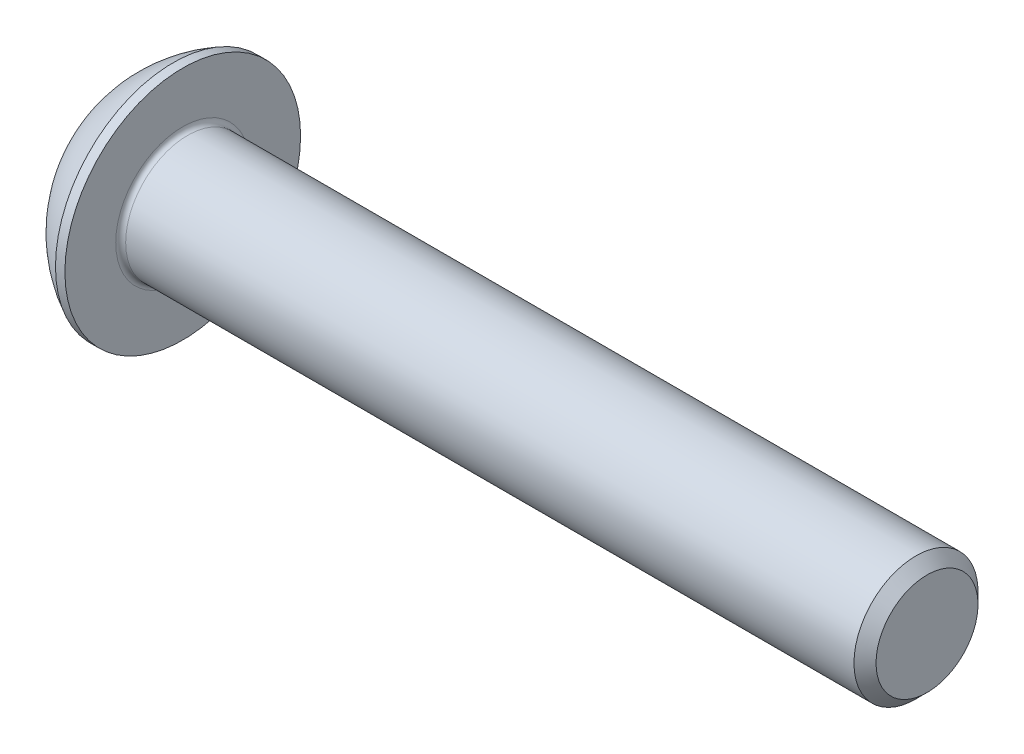
ISO-10303-21;
HEADER;
FILE_DESCRIPTION(('STEP AP214'),'2;1');
FILE_NAME('part.step','',(''),(''),'','','');
FILE_SCHEMA(('AUTOMOTIVE_DESIGN { 1 0 10303 214 1 1 1 1 }'));
ENDSEC;
DATA;
#1=APPLICATION_CONTEXT('core data for automotive mechanical design processes');
#2=APPLICATION_PROTOCOL_DEFINITION('international standard','automotive_design',2000,#1);
#3=PRODUCT_CONTEXT('',#1,'mechanical');
#4=PRODUCT('Part','Part','',(#3));
#5=PRODUCT_RELATED_PRODUCT_CATEGORY('part','',(#4));
#6=PRODUCT_DEFINITION_FORMATION('','',#4);
#7=PRODUCT_DEFINITION_CONTEXT('part definition',#1,'design');
#8=PRODUCT_DEFINITION('design','',#6,#7);
#9=PRODUCT_DEFINITION_SHAPE('','',#8);
#10=(LENGTH_UNIT() NAMED_UNIT(*) SI_UNIT(.MILLI.,.METRE.));
#11=(NAMED_UNIT(*) PLANE_ANGLE_UNIT() SI_UNIT($,.RADIAN.));
#12=(NAMED_UNIT(*) SI_UNIT($,.STERADIAN.) SOLID_ANGLE_UNIT());
#13=UNCERTAINTY_MEASURE_WITH_UNIT(LENGTH_MEASURE(1.E-05),#10,'distance_accuracy_value','');
#14=(GEOMETRIC_REPRESENTATION_CONTEXT(3) GLOBAL_UNCERTAINTY_ASSIGNED_CONTEXT((#13)) GLOBAL_UNIT_ASSIGNED_CONTEXT((#10,
#11,#12)) REPRESENTATION_CONTEXT('',''));
#15=CARTESIAN_POINT('',(0.,0.,0.));
#16=DIRECTION('',(0.,0.,1.));
#17=DIRECTION('',(1.,0.,0.));
#18=AXIS2_PLACEMENT_3D('',#15,#16,#17);
#19=CARTESIAN_POINT('',(0.,0.,0.));
#20=DIRECTION('',(-1.,0.,0.));
#21=DIRECTION('',(0.,0.,1.));
#22=AXIS2_PLACEMENT_3D('',#19,#20,#21);
#23=PLANE('',#22);
#24=CARTESIAN_POINT('',(0.,0.,0.));
#25=DIRECTION('',(-1.,0.,0.));
#26=DIRECTION('',(0.,0.,1.));
#27=AXIS2_PLACEMENT_3D('',#24,#25,#26);
#28=CIRCLE('',#27,2.375);
#29=CARTESIAN_POINT('',(0.,0.,2.375));
#30=VERTEX_POINT('',#29);
#31=EDGE_CURVE('E163',#30,#30,#28,.T.);
#32=ORIENTED_EDGE('',*,*,#31,.T.);
#33=EDGE_LOOP('',(#32));
#34=FACE_BOUND('',#33,.T.);
#35=DIRECTION('',(0.,-1.,0.));
#36=VECTOR('',#35,1.);
#37=CARTESIAN_POINT('',(0.,-0.866025403784438,1.5));
#38=LINE('',#37,#36);
#39=CARTESIAN_POINT('',(0.,0.866025403784439,1.5));
#40=VERTEX_POINT('',#39);
#41=CARTESIAN_POINT('',(0.,-0.866025403784438,1.5));
#42=VERTEX_POINT('',#41);
#43=EDGE_CURVE('E53',#40,#42,#38,.T.);
#44=ORIENTED_EDGE('',*,*,#43,.T.);
#45=DIRECTION('',(0.,-0.5,-0.866025403784439));
#46=VECTOR('',#45,1.);
#47=CARTESIAN_POINT('',(0.,-1.73205080756888,0.));
#48=LINE('',#47,#46);
#49=CARTESIAN_POINT('',(0.,-1.73205080756888,0.));
#50=VERTEX_POINT('',#49);
#51=EDGE_CURVE('E256',#42,#50,#48,.T.);
#52=ORIENTED_EDGE('',*,*,#51,.T.);
#53=DIRECTION('',(0.,0.5,-0.866025403784439));
#54=VECTOR('',#53,1.);
#55=CARTESIAN_POINT('',(0.,-0.866025403784438,-1.5));
#56=LINE('',#55,#54);
#57=CARTESIAN_POINT('',(0.,-0.866025403784438,-1.5));
#58=VERTEX_POINT('',#57);
#59=EDGE_CURVE('E138',#50,#58,#56,.T.);
#60=ORIENTED_EDGE('',*,*,#59,.T.);
#61=DIRECTION('',(0.,1.,0.));
#62=VECTOR('',#61,1.);
#63=CARTESIAN_POINT('',(0.,0.866025403784439,-1.5));
#64=LINE('',#63,#62);
#65=CARTESIAN_POINT('',(0.,0.866025403784439,-1.5));
#66=VERTEX_POINT('',#65);
#67=EDGE_CURVE('E259',#58,#66,#64,.T.);
#68=ORIENTED_EDGE('',*,*,#67,.T.);
#69=DIRECTION('',(0.,0.5,0.866025403784439));
#70=VECTOR('',#69,1.);
#71=CARTESIAN_POINT('',(0.,1.73205080756888,0.));
#72=LINE('',#71,#70);
#73=CARTESIAN_POINT('',(0.,1.73205080756888,0.));
#74=VERTEX_POINT('',#73);
#75=EDGE_CURVE('E261',#66,#74,#72,.T.);
#76=ORIENTED_EDGE('',*,*,#75,.T.);
#77=DIRECTION('',(0.,-0.5,0.866025403784439));
#78=VECTOR('',#77,1.);
#79=CARTESIAN_POINT('',(0.,0.866025403784439,1.5));
#80=LINE('',#79,#78);
#81=EDGE_CURVE('E263',#74,#40,#80,.T.);
#82=ORIENTED_EDGE('',*,*,#81,.T.);
#83=EDGE_LOOP('',(#44,#52,#60,#68,#76,#82));
#84=FACE_BOUND('',#83,.T.);
#85=ADVANCED_FACE('F38',(#34,#84),#23,.T.);
#86=CARTESIAN_POINT('',(4.75501582278481,0.,0.));
#87=DIRECTION('',(-1.,0.,0.));
#88=DIRECTION('',(0.,1.,0.));
#89=AXIS2_PLACEMENT_3D('',#86,#87,#88);
#90=SPHERICAL_SURFACE('',#89,5.3151482081814);
#91=CARTESIAN_POINT('',(2.37,0.,0.));
#92=DIRECTION('',(-1.,0.,0.));
#93=DIRECTION('',(0.,0.,1.));
#94=AXIS2_PLACEMENT_3D('',#91,#92,#93);
#95=CIRCLE('',#94,4.75);
#96=CARTESIAN_POINT('',(2.37,0.,4.75));
#97=VERTEX_POINT('',#96);
#98=EDGE_CURVE('E160',#97,#97,#95,.T.);
#99=ORIENTED_EDGE('',*,*,#98,.T.);
#100=EDGE_LOOP('',(#99));
#101=FACE_BOUND('',#100,.T.);
#102=ORIENTED_EDGE('',*,*,#31,.F.);
#103=EDGE_LOOP('',(#102));
#104=FACE_BOUND('',#103,.T.);
#105=ADVANCED_FACE('F184',(#101,#104),#90,.T.);
#106=CARTESIAN_POINT('',(0.,0.,0.));
#107=DIRECTION('',(-1.,0.,0.));
#108=DIRECTION('',(0.,0.,1.));
#109=AXIS2_PLACEMENT_3D('',#106,#107,#108);
#110=CYLINDRICAL_SURFACE('',#109,4.75);
#111=ORIENTED_EDGE('',*,*,#98,.F.);
#112=EDGE_LOOP('',(#111));
#113=FACE_BOUND('',#112,.T.);
#114=CARTESIAN_POINT('',(2.75,0.,0.));
#115=DIRECTION('',(-1.,0.,0.));
#116=DIRECTION('',(0.,0.,1.));
#117=AXIS2_PLACEMENT_3D('',#114,#115,#116);
#118=CIRCLE('',#117,4.75);
#119=CARTESIAN_POINT('',(2.75,0.,4.75));
#120=VERTEX_POINT('',#119);
#121=EDGE_CURVE('E157',#120,#120,#118,.T.);
#122=ORIENTED_EDGE('',*,*,#121,.T.);
#123=EDGE_LOOP('',(#122));
#124=FACE_BOUND('',#123,.T.);
#125=ADVANCED_FACE('F189',(#113,#124),#110,.T.);
#126=CARTESIAN_POINT('',(2.75,2.5,0.));
#127=DIRECTION('',(-1.,0.,0.));
#128=DIRECTION('',(0.,0.,1.));
#129=AXIS2_PLACEMENT_3D('',#126,#127,#128);
#130=PLANE('',#129);
#131=CARTESIAN_POINT('',(2.75,0.,0.));
#132=DIRECTION('',(-1.,0.,0.));
#133=DIRECTION('',(0.,0.,1.));
#134=AXIS2_PLACEMENT_3D('',#131,#132,#133);
#135=CIRCLE('',#134,2.7);
#136=CARTESIAN_POINT('',(2.75,0.,2.7));
#137=VERTEX_POINT('',#136);
#138=EDGE_CURVE('E46',#137,#137,#135,.T.);
#139=ORIENTED_EDGE('',*,*,#138,.T.);
#140=EDGE_LOOP('',(#139));
#141=FACE_BOUND('',#140,.T.);
#142=ORIENTED_EDGE('',*,*,#121,.F.);
#143=EDGE_LOOP('',(#142));
#144=FACE_BOUND('',#143,.T.);
#145=ADVANCED_FACE('F168',(#141,#144),#130,.F.);
#146=CARTESIAN_POINT('',(0.,0.,0.));
#147=DIRECTION('',(-1.,0.,0.));
#148=DIRECTION('',(0.,0.,1.));
#149=AXIS2_PLACEMENT_3D('',#146,#147,#148);
#150=CYLINDRICAL_SURFACE('',#149,2.5);
#151=CARTESIAN_POINT('',(2.95,0.,0.));
#152=DIRECTION('',(-1.,0.,0.));
#153=DIRECTION('',(0.,0.,1.));
#154=AXIS2_PLACEMENT_3D('',#151,#152,#153);
#155=CIRCLE('',#154,2.5);
#156=CARTESIAN_POINT('',(2.95,0.,2.5));
#157=VERTEX_POINT('',#156);
#158=EDGE_CURVE('E11',#157,#157,#155,.F.);
#159=ORIENTED_EDGE('',*,*,#158,.T.);
#160=EDGE_LOOP('',(#159));
#161=FACE_BOUND('',#160,.T.);
#162=CARTESIAN_POINT('',(32.305,0.,0.));
#163=DIRECTION('',(-1.,0.,0.));
#164=DIRECTION('',(0.,0.,1.));
#165=AXIS2_PLACEMENT_3D('',#162,#163,#164);
#166=CIRCLE('',#165,2.5);
#167=CARTESIAN_POINT('',(32.305,0.,2.5));
#168=VERTEX_POINT('',#167);
#169=EDGE_CURVE('E154',#168,#168,#166,.T.);
#170=ORIENTED_EDGE('',*,*,#169,.T.);
#171=EDGE_LOOP('',(#170));
#172=FACE_BOUND('',#171,.T.);
#173=ADVANCED_FACE('F198',(#161,#172),#150,.T.);
#174=CARTESIAN_POINT('',(32.75,0.,0.));
#175=DIRECTION('',(-1.,0.,0.));
#176=DIRECTION('',(0.,0.,1.));
#177=AXIS2_PLACEMENT_3D('',#174,#175,#176);
#178=CONICAL_SURFACE('',#177,2.055,0.785398163397436);
#179=ORIENTED_EDGE('',*,*,#169,.F.);
#180=EDGE_LOOP('',(#179));
#181=FACE_BOUND('',#180,.T.);
#182=CARTESIAN_POINT('',(32.75,0.,0.));
#183=DIRECTION('',(-1.,0.,0.));
#184=DIRECTION('',(0.,0.,1.));
#185=AXIS2_PLACEMENT_3D('',#182,#183,#184);
#186=CIRCLE('',#185,2.055);
#187=CARTESIAN_POINT('',(32.75,0.,2.055));
#188=VERTEX_POINT('',#187);
#189=EDGE_CURVE('E150',#188,#188,#186,.T.);
#190=ORIENTED_EDGE('',*,*,#189,.T.);
#191=EDGE_LOOP('',(#190));
#192=FACE_BOUND('',#191,.T.);
#193=ADVANCED_FACE('F179',(#181,#192),#178,.T.);
#194=CARTESIAN_POINT('',(32.75,0.,0.));
#195=DIRECTION('',(-1.,0.,0.));
#196=DIRECTION('',(0.,0.,1.));
#197=AXIS2_PLACEMENT_3D('',#194,#195,#196);
#198=PLANE('',#197);
#199=ORIENTED_EDGE('',*,*,#189,.F.);
#200=EDGE_LOOP('',(#199));
#201=FACE_BOUND('',#200,.T.);
#202=ADVANCED_FACE('F172',(#201),#198,.F.);
#203=CARTESIAN_POINT('',(2.95,0.,0.));
#204=DIRECTION('',(-1.,0.,0.));
#205=DIRECTION('',(0.,0.,1.));
#206=AXIS2_PLACEMENT_3D('',#203,#204,#205);
#207=TOROIDAL_SURFACE('',#206,2.7,0.2);
#208=ORIENTED_EDGE('',*,*,#158,.F.);
#209=EDGE_LOOP('',(#208));
#210=FACE_BOUND('',#209,.T.);
#211=ORIENTED_EDGE('',*,*,#138,.F.);
#212=EDGE_LOOP('',(#211));
#213=FACE_BOUND('',#212,.T.);
#214=ADVANCED_FACE('F40',(#210,#213),#207,.F.);
#215=CARTESIAN_POINT('',(1.56,-1.73205080756888,0.));
#216=DIRECTION('',(0.,0.866025403784439,-0.5));
#217=DIRECTION('',(0.,0.5,0.866025403784439));
#218=AXIS2_PLACEMENT_3D('',#215,#216,#217);
#219=PLANE('',#218);
#220=DIRECTION('',(0.,-0.5,-0.866025403784439));
#221=VECTOR('',#220,1.);
#222=CARTESIAN_POINT('',(1.56,-1.73205080756888,0.));
#223=LINE('',#222,#221);
#224=CARTESIAN_POINT('',(1.56,-0.866025403784438,1.5));
#225=VERTEX_POINT('',#224);
#226=CARTESIAN_POINT('',(1.56,-1.29903810567666,0.749999999999999));
#227=VERTEX_POINT('',#226);
#228=EDGE_CURVE('E121',#225,#227,#223,.T.);
#229=ORIENTED_EDGE('',*,*,#228,.T.);
#230=CARTESIAN_POINT('',(1.56,-1.73205080756888,0.));
#231=VERTEX_POINT('',#230);
#232=EDGE_CURVE('E114',#227,#231,#223,.T.);
#233=ORIENTED_EDGE('',*,*,#232,.T.);
#234=DIRECTION('',(-1.,0.,0.));
#235=VECTOR('',#234,1.);
#236=CARTESIAN_POINT('',(1.56,-1.73205080756888,0.));
#237=LINE('',#236,#235);
#238=EDGE_CURVE('E118',#231,#50,#237,.T.);
#239=ORIENTED_EDGE('',*,*,#238,.T.);
#240=ORIENTED_EDGE('',*,*,#51,.F.);
#241=DIRECTION('',(-1.,0.,0.));
#242=VECTOR('',#241,1.);
#243=CARTESIAN_POINT('',(1.56,-0.866025403784438,1.5));
#244=LINE('',#243,#242);
#245=EDGE_CURVE('E246',#225,#42,#244,.T.);
#246=ORIENTED_EDGE('',*,*,#245,.F.);
#247=EDGE_LOOP('',(#229,#233,#239,#240,#246));
#248=FACE_BOUND('',#247,.T.);
#249=ADVANCED_FACE('F116',(#248),#219,.T.);
#250=CARTESIAN_POINT('',(1.56,-0.866025403784438,-1.5));
#251=DIRECTION('',(0.,0.866025403784439,0.5));
#252=DIRECTION('',(0.,-0.5,0.866025403784439));
#253=AXIS2_PLACEMENT_3D('',#250,#251,#252);
#254=PLANE('',#253);
#255=DIRECTION('',(0.,0.5,-0.866025403784439));
#256=VECTOR('',#255,1.);
#257=CARTESIAN_POINT('',(1.56,-0.866025403784438,-1.5));
#258=LINE('',#257,#256);
#259=CARTESIAN_POINT('',(1.56,-1.29903810567666,-0.749999999999999));
#260=VERTEX_POINT('',#259);
#261=EDGE_CURVE('E126',#231,#260,#258,.T.);
#262=ORIENTED_EDGE('',*,*,#261,.T.);
#263=CARTESIAN_POINT('',(1.56,-0.866025403784438,-1.5));
#264=VERTEX_POINT('',#263);
#265=EDGE_CURVE('E133',#260,#264,#258,.T.);
#266=ORIENTED_EDGE('',*,*,#265,.T.);
#267=DIRECTION('',(-1.,0.,0.));
#268=VECTOR('',#267,1.);
#269=CARTESIAN_POINT('',(1.56,-0.866025403784438,-1.5));
#270=LINE('',#269,#268);
#271=EDGE_CURVE('E140',#264,#58,#270,.T.);
#272=ORIENTED_EDGE('',*,*,#271,.T.);
#273=ORIENTED_EDGE('',*,*,#59,.F.);
#274=ORIENTED_EDGE('',*,*,#238,.F.);
#275=EDGE_LOOP('',(#262,#266,#272,#273,#274));
#276=FACE_BOUND('',#275,.T.);
#277=ADVANCED_FACE('F136',(#276),#254,.T.);
#278=CARTESIAN_POINT('',(1.56,0.866025403784439,-1.5));
#279=DIRECTION('',(0.,0.,1.));
#280=DIRECTION('',(1.,0.,0.));
#281=AXIS2_PLACEMENT_3D('',#278,#279,#280);
#282=PLANE('',#281);
#283=DIRECTION('',(0.,1.,0.));
#284=VECTOR('',#283,1.);
#285=CARTESIAN_POINT('',(1.56,0.866025403784439,-1.5));
#286=LINE('',#285,#284);
#287=CARTESIAN_POINT('',(1.56,0.,-1.5));
#288=VERTEX_POINT('',#287);
#289=EDGE_CURVE('E282',#264,#288,#286,.T.);
#290=ORIENTED_EDGE('',*,*,#289,.T.);
#291=CARTESIAN_POINT('',(1.56,0.866025403784439,-1.5));
#292=VERTEX_POINT('',#291);
#293=EDGE_CURVE('E132',#288,#292,#286,.T.);
#294=ORIENTED_EDGE('',*,*,#293,.T.);
#295=DIRECTION('',(-1.,0.,0.));
#296=VECTOR('',#295,1.);
#297=CARTESIAN_POINT('',(1.56,0.866025403784439,-1.5));
#298=LINE('',#297,#296);
#299=EDGE_CURVE('E145',#292,#66,#298,.T.);
#300=ORIENTED_EDGE('',*,*,#299,.T.);
#301=ORIENTED_EDGE('',*,*,#67,.F.);
#302=ORIENTED_EDGE('',*,*,#271,.F.);
#303=EDGE_LOOP('',(#290,#294,#300,#301,#302));
#304=FACE_BOUND('',#303,.T.);
#305=ADVANCED_FACE('F212',(#304),#282,.T.);
#306=CARTESIAN_POINT('',(1.56,1.73205080756888,0.));
#307=DIRECTION('',(0.,-0.866025403784438,0.5));
#308=DIRECTION('',(0.,-0.5,-0.866025403784439));
#309=AXIS2_PLACEMENT_3D('',#306,#307,#308);
#310=PLANE('',#309);
#311=DIRECTION('',(0.,0.5,0.866025403784439));
#312=VECTOR('',#311,1.);
#313=CARTESIAN_POINT('',(1.56,1.73205080756888,0.));
#314=LINE('',#313,#312);
#315=CARTESIAN_POINT('',(1.56,1.29903810567666,-0.750000000000001));
#316=VERTEX_POINT('',#315);
#317=EDGE_CURVE('E288',#292,#316,#314,.T.);
#318=ORIENTED_EDGE('',*,*,#317,.T.);
#319=CARTESIAN_POINT('',(1.56,1.73205080756888,0.));
#320=VERTEX_POINT('',#319);
#321=EDGE_CURVE('E286',#316,#320,#314,.T.);
#322=ORIENTED_EDGE('',*,*,#321,.T.);
#323=DIRECTION('',(-1.,0.,0.));
#324=VECTOR('',#323,1.);
#325=CARTESIAN_POINT('',(1.56,1.73205080756888,0.));
#326=LINE('',#325,#324);
#327=EDGE_CURVE('E268',#320,#74,#326,.T.);
#328=ORIENTED_EDGE('',*,*,#327,.T.);
#329=ORIENTED_EDGE('',*,*,#75,.F.);
#330=ORIENTED_EDGE('',*,*,#299,.F.);
#331=EDGE_LOOP('',(#318,#322,#328,#329,#330));
#332=FACE_BOUND('',#331,.T.);
#333=ADVANCED_FACE('F215',(#332),#310,.T.);
#334=CARTESIAN_POINT('',(1.56,0.866025403784439,1.5));
#335=DIRECTION('',(0.,-0.866025403784439,-0.5));
#336=DIRECTION('',(0.,0.5,-0.866025403784439));
#337=AXIS2_PLACEMENT_3D('',#334,#335,#336);
#338=PLANE('',#337);
#339=DIRECTION('',(0.,-0.5,0.866025403784439));
#340=VECTOR('',#339,1.);
#341=CARTESIAN_POINT('',(1.56,0.866025403784439,1.5));
#342=LINE('',#341,#340);
#343=CARTESIAN_POINT('',(1.56,1.29903810567666,0.75));
#344=VERTEX_POINT('',#343);
#345=EDGE_CURVE('E252',#320,#344,#342,.T.);
#346=ORIENTED_EDGE('',*,*,#345,.T.);
#347=CARTESIAN_POINT('',(1.56,0.866025403784439,1.5));
#348=VERTEX_POINT('',#347);
#349=EDGE_CURVE('E244',#344,#348,#342,.T.);
#350=ORIENTED_EDGE('',*,*,#349,.T.);
#351=DIRECTION('',(-1.,0.,0.));
#352=VECTOR('',#351,1.);
#353=CARTESIAN_POINT('',(1.56,0.866025403784439,1.5));
#354=LINE('',#353,#352);
#355=EDGE_CURVE('E250',#348,#40,#354,.T.);
#356=ORIENTED_EDGE('',*,*,#355,.T.);
#357=ORIENTED_EDGE('',*,*,#81,.F.);
#358=ORIENTED_EDGE('',*,*,#327,.F.);
#359=EDGE_LOOP('',(#346,#350,#356,#357,#358));
#360=FACE_BOUND('',#359,.T.);
#361=ADVANCED_FACE('F219',(#360),#338,.T.);
#362=CARTESIAN_POINT('',(1.56,-0.866025403784438,1.5));
#363=DIRECTION('',(0.,0.,-1.));
#364=DIRECTION('',(-1.,0.,0.));
#365=AXIS2_PLACEMENT_3D('',#362,#363,#364);
#366=PLANE('',#365);
#367=DIRECTION('',(0.,-1.,0.));
#368=VECTOR('',#367,1.);
#369=CARTESIAN_POINT('',(1.56,-0.866025403784438,1.5));
#370=LINE('',#369,#368);
#371=CARTESIAN_POINT('',(1.56,0.,1.5));
#372=VERTEX_POINT('',#371);
#373=EDGE_CURVE('E61',#348,#372,#370,.T.);
#374=ORIENTED_EDGE('',*,*,#373,.T.);
#375=EDGE_CURVE('E247',#372,#225,#370,.T.);
#376=ORIENTED_EDGE('',*,*,#375,.T.);
#377=ORIENTED_EDGE('',*,*,#245,.T.);
#378=ORIENTED_EDGE('',*,*,#43,.F.);
#379=ORIENTED_EDGE('',*,*,#355,.F.);
#380=EDGE_LOOP('',(#374,#376,#377,#378,#379));
#381=FACE_BOUND('',#380,.T.);
#382=ADVANCED_FACE('F223',(#381),#366,.T.);
#383=CARTESIAN_POINT('',(1.56,-0.866025403784438,1.5));
#384=DIRECTION('',(-1.,0.,0.));
#385=DIRECTION('',(0.,0.,1.));
#386=AXIS2_PLACEMENT_3D('',#383,#384,#385);
#387=PLANE('',#386);
#388=ORIENTED_EDGE('',*,*,#373,.F.);
#389=ORIENTED_EDGE('',*,*,#349,.F.);
#390=CARTESIAN_POINT('',(1.56,0.,0.));
#391=DIRECTION('',(-1.,0.,0.));
#392=DIRECTION('',(0.,0.,1.));
#393=AXIS2_PLACEMENT_3D('',#390,#391,#392);
#394=CIRCLE('',#393,1.5);
#395=EDGE_CURVE('E144',#372,#344,#394,.T.);
#396=ORIENTED_EDGE('',*,*,#395,.F.);
#397=EDGE_LOOP('',(#388,#389,#396));
#398=FACE_BOUND('',#397,.T.);
#399=ADVANCED_FACE('F227',(#398),#387,.T.);
#400=ORIENTED_EDGE('',*,*,#345,.F.);
#401=ORIENTED_EDGE('',*,*,#321,.F.);
#402=EDGE_CURVE('E151',#344,#316,#394,.T.);
#403=ORIENTED_EDGE('',*,*,#402,.F.);
#404=EDGE_LOOP('',(#400,#401,#403));
#405=FACE_BOUND('',#404,.T.);
#406=ADVANCED_FACE('F235',(#405),#387,.T.);
#407=ORIENTED_EDGE('',*,*,#317,.F.);
#408=ORIENTED_EDGE('',*,*,#293,.F.);
#409=EDGE_CURVE('E293',#316,#288,#394,.T.);
#410=ORIENTED_EDGE('',*,*,#409,.F.);
#411=EDGE_LOOP('',(#407,#408,#410));
#412=FACE_BOUND('',#411,.T.);
#413=ADVANCED_FACE('F240',(#412),#387,.T.);
#414=ORIENTED_EDGE('',*,*,#289,.F.);
#415=ORIENTED_EDGE('',*,*,#265,.F.);
#416=EDGE_CURVE('E285',#288,#260,#394,.T.);
#417=ORIENTED_EDGE('',*,*,#416,.F.);
#418=EDGE_LOOP('',(#414,#415,#417));
#419=FACE_BOUND('',#418,.T.);
#420=ADVANCED_FACE('F233',(#419),#387,.T.);
#421=ORIENTED_EDGE('',*,*,#261,.F.);
#422=ORIENTED_EDGE('',*,*,#232,.F.);
#423=EDGE_CURVE('E128',#260,#227,#394,.T.);
#424=ORIENTED_EDGE('',*,*,#423,.F.);
#425=EDGE_LOOP('',(#421,#422,#424));
#426=FACE_BOUND('',#425,.T.);
#427=ADVANCED_FACE('F127',(#426),#387,.T.);
#428=ORIENTED_EDGE('',*,*,#228,.F.);
#429=ORIENTED_EDGE('',*,*,#375,.F.);
#430=EDGE_CURVE('E139',#227,#372,#394,.T.);
#431=ORIENTED_EDGE('',*,*,#430,.F.);
#432=EDGE_LOOP('',(#428,#429,#431));
#433=FACE_BOUND('',#432,.T.);
#434=ADVANCED_FACE('F207',(#433),#387,.T.);
#435=CARTESIAN_POINT('',(2.42602540378445,0.,0.));
#436=DIRECTION('',(-1.,0.,0.));
#437=DIRECTION('',(0.,0.,1.));
#438=AXIS2_PLACEMENT_3D('',#435,#436,#437);
#439=CONICAL_SURFACE('',#438,0.,1.04719755119659);
#440=ORIENTED_EDGE('',*,*,#395,.T.);
#441=ORIENTED_EDGE('',*,*,#402,.T.);
#442=ORIENTED_EDGE('',*,*,#409,.T.);
#443=ORIENTED_EDGE('',*,*,#416,.T.);
#444=ORIENTED_EDGE('',*,*,#423,.T.);
#445=ORIENTED_EDGE('',*,*,#430,.T.);
#446=EDGE_LOOP('',(#440,#441,#442,#443,#444,#445));
#447=FACE_BOUND('',#446,.T.);
#448=CARTESIAN_POINT('',(2.42602540378445,0.,0.));
#449=VERTEX_POINT('',#448);
#450=VERTEX_LOOP('',#449);
#451=FACE_BOUND('',#450,.T.);
#452=ADVANCED_FACE('F205',(#447,#451),#439,.F.);
#453=CLOSED_SHELL('',(#85,#105,#125,#145,#173,#193,#202,#214,#249,#277,#305,#333,#361,#382,#399,
#406,#413,#420,#427,#434,#452));
#454=MANIFOLD_SOLID_BREP('B2',#453);
#455=ADVANCED_BREP_SHAPE_REPRESENTATION('',(#18,#454),#14);
#456=SHAPE_DEFINITION_REPRESENTATION(#9,#455);
ENDSEC;
END-ISO-10303-21;
